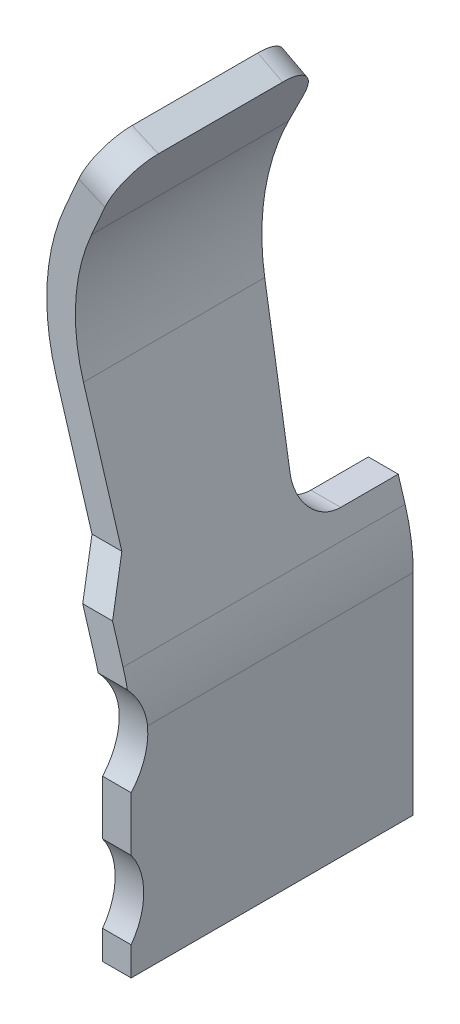
ISO-10303-21;
HEADER;
FILE_DESCRIPTION(('STEP AP214'),'2;1');
FILE_NAME('part.step','',(''),(''),'','','');
FILE_SCHEMA(('AUTOMOTIVE_DESIGN { 1 0 10303 214 1 1 1 1 }'));
ENDSEC;
DATA;
#1=APPLICATION_CONTEXT('core data for automotive mechanical design processes');
#2=APPLICATION_PROTOCOL_DEFINITION('international standard','automotive_design',2000,#1);
#3=PRODUCT_CONTEXT('',#1,'mechanical');
#4=PRODUCT('Part','Part','',(#3));
#5=PRODUCT_RELATED_PRODUCT_CATEGORY('part','',(#4));
#6=PRODUCT_DEFINITION_FORMATION('','',#4);
#7=PRODUCT_DEFINITION_CONTEXT('part definition',#1,'design');
#8=PRODUCT_DEFINITION('design','',#6,#7);
#9=PRODUCT_DEFINITION_SHAPE('','',#8);
#10=(LENGTH_UNIT() NAMED_UNIT(*) SI_UNIT(.MILLI.,.METRE.));
#11=(NAMED_UNIT(*) PLANE_ANGLE_UNIT() SI_UNIT($,.RADIAN.));
#12=(NAMED_UNIT(*) SI_UNIT($,.STERADIAN.) SOLID_ANGLE_UNIT());
#13=UNCERTAINTY_MEASURE_WITH_UNIT(LENGTH_MEASURE(1.E-05),#10,'distance_accuracy_value','');
#14=(GEOMETRIC_REPRESENTATION_CONTEXT(3) GLOBAL_UNCERTAINTY_ASSIGNED_CONTEXT((#13)) GLOBAL_UNIT_ASSIGNED_CONTEXT((#10,
#11,#12)) REPRESENTATION_CONTEXT('',''));
#15=CARTESIAN_POINT('',(0.,0.,0.));
#16=DIRECTION('',(0.,0.,1.));
#17=DIRECTION('',(1.,0.,0.));
#18=AXIS2_PLACEMENT_3D('',#15,#16,#17);
#19=CARTESIAN_POINT('',(-10.8215550668189,3.52330708865174,0.423604352914839));
#20=DIRECTION('',(0.915327071470026,-0.402711251685505,0.));
#21=DIRECTION('',(0.402711251685505,0.915327071470026,0.));
#22=AXIS2_PLACEMENT_3D('',#19,#20,#21);
#23=CYLINDRICAL_SURFACE('',#22,0.2);
#24=CARTESIAN_POINT('',(-10.8215550668189,3.52330708865174,0.423604352914839));
#25=DIRECTION('',(-0.915327071470029,0.402711251685498,0.));
#26=DIRECTION('',(0.402711251685498,0.915327071470029,0.));
#27=AXIS2_PLACEMENT_3D('',#24,#25,#26);
#28=CIRCLE('',#27,0.2);
#29=CARTESIAN_POINT('',(-10.8215550668189,3.52330708865174,0.623604352914839));
#30=VERTEX_POINT('',#29);
#31=CARTESIAN_POINT('',(-10.7410128164818,3.70637250294574,0.423604352914839));
#32=VERTEX_POINT('',#31);
#33=EDGE_CURVE('E286',#30,#32,#28,.T.);
#34=ORIENTED_EDGE('',*,*,#33,.F.);
#35=DIRECTION('',(-0.915327071470027,0.402711251685503,0.));
#36=VECTOR('',#35,1.);
#37=CARTESIAN_POINT('',(-35.4315059297134,14.3508073613119,0.623604352914805));
#38=LINE('',#37,#36);
#39=CARTESIAN_POINT('',(-10.6842560060984,3.46290040089891,0.623604352914839));
#40=VERTEX_POINT('',#39);
#41=EDGE_CURVE('E27',#40,#30,#38,.T.);
#42=ORIENTED_EDGE('',*,*,#41,.F.);
#43=CARTESIAN_POINT('',(-10.6842560060984,3.46290040089891,0.423604352914839));
#44=DIRECTION('',(0.915327071470029,-0.402711251685498,0.));
#45=DIRECTION('',(-0.402711251685498,-0.915327071470029,0.));
#46=AXIS2_PLACEMENT_3D('',#43,#44,#45);
#47=CIRCLE('',#46,0.2);
#48=CARTESIAN_POINT('',(-10.6037137557613,3.64596581519291,0.423604352914839));
#49=VERTEX_POINT('',#48);
#50=EDGE_CURVE('E264',#49,#40,#47,.T.);
#51=ORIENTED_EDGE('',*,*,#50,.F.);
#52=DIRECTION('',(0.915327071470027,-0.402711251685503,0.));
#53=VECTOR('',#52,1.);
#54=CARTESIAN_POINT('',(-10.7410128164818,3.70637250294574,0.423604352914839));
#55=LINE('',#54,#53);
#56=EDGE_CURVE('E330',#32,#49,#55,.T.);
#57=ORIENTED_EDGE('',*,*,#56,.F.);
#58=EDGE_LOOP('',(#34,#42,#51,#57));
#59=FACE_BOUND('',#58,.T.);
#60=ADVANCED_FACE('F16',(#59),#23,.T.);
#61=CARTESIAN_POINT('',(-10.84386274133,3.53312166947706,-0.236832722369337));
#62=DIRECTION('',(-0.914255270392897,0.402239697454475,-0.0483789866630451));
#63=DIRECTION('',(-0.402711251685505,-0.915327071470026,0.));
#64=AXIS2_PLACEMENT_3D('',#61,#62,#63);
#65=CYLINDRICAL_SURFACE('',#64,0.2);
#66=CARTESIAN_POINT('',(-10.6930594619542,3.44289092405021,-0.427421697659668));
#67=CARTESIAN_POINT('',(-10.6419825348076,3.55898426375477,-0.441384710680955));
#68=CARTESIAN_POINT('',(-10.6037137557613,3.64596581519291,-0.356133634256614));
#69=CARTESIAN_POINT('',(-10.6037137557613,3.64596581519291,-0.228386927890316));
#70=(BOUNDED_CURVE() B_SPLINE_CURVE(3,(#66,#67,#68,#69),.UNSPECIFIED.,.F.,
.F.) B_SPLINE_CURVE_WITH_KNOTS((4,4),(6.17366415670651,7.85398163397443),
.UNSPECIFIED.) CURVE() GEOMETRIC_REPRESENTATION_ITEM() RATIONAL_B_SPLINE_CURVE((1.,
0.778229742533869,0.778229742533869,1.)) REPRESENTATION_ITEM(''));
#71=CARTESIAN_POINT('',(-10.6930594619542,3.44289092405021,-0.427421697659668));
#72=VERTEX_POINT('',#71);
#73=CARTESIAN_POINT('',(-10.6037137557613,3.64596581519291,-0.228386927890316));
#74=VERTEX_POINT('',#73);
#75=EDGE_CURVE('E272',#72,#74,#70,.T.);
#76=ORIENTED_EDGE('',*,*,#75,.F.);
#77=DIRECTION('',(0.914255270392898,-0.402239697454473,0.0483789866630451));
#78=VECTOR('',#77,1.);
#79=CARTESIAN_POINT('',(-36.031852655037,14.5910558161891,-1.76825633941021));
#80=LINE('',#79,#78);
#81=CARTESIAN_POINT('',(-10.8303585226747,3.50329761180303,-0.434687053017796));
#82=VERTEX_POINT('',#81);
#83=EDGE_CURVE('E11',#82,#72,#80,.T.);
#84=ORIENTED_EDGE('',*,*,#83,.F.);
#85=CARTESIAN_POINT('',(-10.7410128164818,3.70637250294574,-0.235652283248443));
#86=CARTESIAN_POINT('',(-10.7410128164818,3.70637250294574,-0.363398989614741));
#87=CARTESIAN_POINT('',(-10.7792815955281,3.61939095150759,-0.448650066039082));
#88=CARTESIAN_POINT('',(-10.8303585226747,3.50329761180303,-0.434687053017796));
#89=(BOUNDED_CURVE() B_SPLINE_CURVE(3,(#85,#86,#87,#88),.UNSPECIFIED.,.F.,
.F.) B_SPLINE_CURVE_WITH_KNOTS((4,4),(4.71238898038476,6.39270645765268),
.UNSPECIFIED.) CURVE() GEOMETRIC_REPRESENTATION_ITEM() RATIONAL_B_SPLINE_CURVE((1.,
0.778229742533871,0.778229742533871,1.)) REPRESENTATION_ITEM(''));
#90=CARTESIAN_POINT('',(-10.7410128164818,3.70637250294574,-0.235652283248443));
#91=VERTEX_POINT('',#90);
#92=EDGE_CURVE('E258',#91,#82,#89,.T.);
#93=ORIENTED_EDGE('',*,*,#92,.F.);
#94=DIRECTION('',(-0.914255270392898,0.402239697454473,-0.0483789866630451));
#95=VECTOR('',#94,1.);
#96=CARTESIAN_POINT('',(-10.7633204909929,3.71618708377106,-0.236832722369337));
#97=LINE('',#96,#95);
#98=EDGE_CURVE('E327',#74,#91,#97,.T.);
#99=ORIENTED_EDGE('',*,*,#98,.F.);
#100=EDGE_LOOP('',(#76,#84,#93,#99));
#101=FACE_BOUND('',#100,.T.);
#102=ADVANCED_FACE('F885',(#101),#65,.T.);
#103=CARTESIAN_POINT('',(-40.89,1.65634067151207,-0.212546111318104));
#104=DIRECTION('',(0.,-1.,0.));
#105=DIRECTION('',(0.,0.,-1.));
#106=AXIS2_PLACEMENT_3D('',#103,#104,#105);
#107=PLANE('',#106);
#108=DIRECTION('',(0.,0.,-1.));
#109=VECTOR('',#108,1.);
#110=CARTESIAN_POINT('',(-10.6651649210585,1.65634067151207,-0.740000000000018));
#111=LINE('',#110,#109);
#112=CARTESIAN_POINT('',(-10.6651649210585,1.65634067151207,-0.438042305987952));
#113=VERTEX_POINT('',#112);
#114=CARTESIAN_POINT('',(-10.6651649210585,1.65634067151207,-0.740000000000018));
#115=VERTEX_POINT('',#114);
#116=EDGE_CURVE('E241',#113,#115,#111,.T.);
#117=ORIENTED_EDGE('',*,*,#116,.F.);
#118=DIRECTION('',(1.,0.,0.));
#119=VECTOR('',#118,1.);
#120=CARTESIAN_POINT('',(-10.5084965908944,1.65634067151207,-0.438042305987951));
#121=LINE('',#120,#119);
#122=CARTESIAN_POINT('',(-10.5084965908944,1.65634067151207,-0.438042305987951));
#123=VERTEX_POINT('',#122);
#124=EDGE_CURVE('E250',#113,#123,#121,.T.);
#125=ORIENTED_EDGE('',*,*,#124,.T.);
#126=DIRECTION('',(0.,0.,1.));
#127=VECTOR('',#126,1.);
#128=CARTESIAN_POINT('',(-10.5084965908944,1.65634067151207,-0.740000000000018));
#129=LINE('',#128,#127);
#130=CARTESIAN_POINT('',(-10.5084965908944,1.65634067151207,-0.740000000000018));
#131=VERTEX_POINT('',#130);
#132=EDGE_CURVE('E178',#131,#123,#129,.T.);
#133=ORIENTED_EDGE('',*,*,#132,.F.);
#134=DIRECTION('',(-1.,0.,0.));
#135=VECTOR('',#134,1.);
#136=CARTESIAN_POINT('',(-11.43,1.65634067151207,-0.740000000000019));
#137=LINE('',#136,#135);
#138=EDGE_CURVE('E175',#131,#115,#137,.T.);
#139=ORIENTED_EDGE('',*,*,#138,.T.);
#140=EDGE_LOOP('',(#117,#125,#133,#139));
#141=FACE_BOUND('',#140,.T.);
#142=ADVANCED_FACE('F910',(#141),#107,.F.);
#143=CARTESIAN_POINT('',(-40.89,3.70637250294571,-0.459111687165995));
#144=DIRECTION('',(0.,0.119413416546905,0.992844618230162));
#145=DIRECTION('',(1.,0.,0.));
#146=AXIS2_PLACEMENT_3D('',#143,#144,#145);
#147=PLANE('',#146);
#148=DIRECTION('',(-0.28674853992682,0.951150986717314,-0.11439875574724));
#149=VECTOR('',#148,1.);
#150=CARTESIAN_POINT('',(-10.4903360451115,1.59610175610151,-0.205300934614502));
#151=LINE('',#150,#149);
#152=CARTESIAN_POINT('',(-10.5759916925664,1.88022335482146,-0.239473382341919));
#153=VERTEX_POINT('',#152);
#154=CARTESIAN_POINT('',(-10.7965862640963,2.61194022573825,-0.327479914176621));
#155=VERTEX_POINT('',#154);
#156=EDGE_CURVE('E185',#153,#155,#151,.T.);
#157=ORIENTED_EDGE('',*,*,#156,.F.);
#158=DIRECTION('',(-1.,0.,0.));
#159=VECTOR('',#158,1.);
#160=CARTESIAN_POINT('',(-10.6651649210585,1.88022335482146,-0.23947338234192));
#161=LINE('',#160,#159);
#162=CARTESIAN_POINT('',(-10.7326600227304,1.88022335482146,-0.23947338234192));
#163=VERTEX_POINT('',#162);
#164=EDGE_CURVE('E227',#153,#163,#161,.T.);
#165=ORIENTED_EDGE('',*,*,#164,.T.);
#166=DIRECTION('',(0.286748539926818,-0.951150986717315,0.11439875574724));
#167=VECTOR('',#166,1.);
#168=CARTESIAN_POINT('',(-10.6341223648881,1.55337185451571,-0.200161637444145));
#169=LINE('',#168,#167);
#170=CARTESIAN_POINT('',(-10.9402017604538,2.56864369924933,-0.322272466749579));
#171=VERTEX_POINT('',#170);
#172=EDGE_CURVE('E238',#171,#163,#169,.T.);
#173=ORIENTED_EDGE('',*,*,#172,.F.);
#174=CARTESIAN_POINT('',(-10.8917757539039,3.36370167510267,-0.417897288102545));
#175=CARTESIAN_POINT('',(-11.0033007949067,3.11021511680704,-0.387409439934768));
#176=CARTESIAN_POINT('',(-11.020137394596,2.83379189253285,-0.354162906673266));
#177=CARTESIAN_POINT('',(-10.9402017604538,2.56864369924933,-0.322272466749579));
#178=(BOUNDED_CURVE() B_SPLINE_CURVE(3,(#174,#175,#176,#177),.UNSPECIFIED.,.F.,
.F.) B_SPLINE_CURVE_WITH_KNOTS((4,4),(4.29791199977039,5.00519872138853),
.UNSPECIFIED.) CURVE() GEOMETRIC_REPRESENTATION_ITEM() RATIONAL_B_SPLINE_CURVE((1.,
0.958744787021091,0.958744787021091,1.)) REPRESENTATION_ITEM(''));
#179=CARTESIAN_POINT('',(-10.8917757539039,3.36370167510267,-0.417897288102545));
#180=VERTEX_POINT('',#179);
#181=EDGE_CURVE('E270',#180,#171,#178,.T.);
#182=ORIENTED_EDGE('',*,*,#181,.F.);
#183=DIRECTION('',(-0.400292818236851,-0.909830186054405,0.109428936813832));
#184=VECTOR('',#183,1.);
#185=CARTESIAN_POINT('',(-10.8776664899118,3.39577078475993,-0.421754368938234));
#186=LINE('',#185,#184);
#187=EDGE_CURVE('E287',#82,#180,#186,.T.);
#188=ORIENTED_EDGE('',*,*,#187,.F.);
#189=ORIENTED_EDGE('',*,*,#83,.T.);
#190=DIRECTION('',(0.400292818236852,0.909830186054405,-0.109428936813832));
#191=VECTOR('',#190,1.);
#192=CARTESIAN_POINT('',(-10.7400491803441,3.33608744850051,-0.414576013974332));
#193=LINE('',#192,#191);
#194=CARTESIAN_POINT('',(-10.7544766931834,3.30329498734983,-0.410631932744417));
#195=VERTEX_POINT('',#194);
#196=EDGE_CURVE('E278',#195,#72,#193,.T.);
#197=ORIENTED_EDGE('',*,*,#196,.F.);
#198=CARTESIAN_POINT('',(-10.7965862640963,2.61194022573825,-0.327479914176621));
#199=CARTESIAN_POINT('',(-10.8660955111766,2.84250387207174,-0.355210731501565));
#200=CARTESIAN_POINT('',(-10.8514549897076,3.08287189317973,-0.384120760424611));
#201=CARTESIAN_POINT('',(-10.7544766931834,3.30329498734983,-0.410631932744417));
#202=(BOUNDED_CURVE() B_SPLINE_CURVE(3,(#198,#199,#200,#201),.UNSPECIFIED.,.F.,
.F.) B_SPLINE_CURVE_WITH_KNOTS((4,4),(1.27798658579106,1.98527330740919),
.UNSPECIFIED.) CURVE() GEOMETRIC_REPRESENTATION_ITEM() RATIONAL_B_SPLINE_CURVE((1.,
0.958744787021091,0.958744787021091,1.)) REPRESENTATION_ITEM(''));
#203=EDGE_CURVE('E189',#155,#195,#202,.T.);
#204=ORIENTED_EDGE('',*,*,#203,.F.);
#205=EDGE_LOOP('',(#157,#165,#173,#182,#188,#189,#197,#204));
#206=FACE_BOUND('',#205,.T.);
#207=ADVANCED_FACE('F396',(#206),#147,.F.);
#208=CARTESIAN_POINT('',(-40.89,1.94413292378283,0.623604352914797));
#209=DIRECTION('',(0.,0.,-1.));
#210=DIRECTION('',(0.,-1.,0.));
#211=AXIS2_PLACEMENT_3D('',#208,#209,#210);
#212=PLANE('',#211);
#213=DIRECTION('',(-0.402711251685501,-0.915327071470028,0.));
#214=VECTOR('',#213,1.);
#215=CARTESIAN_POINT('',(-10.7544766931834,3.30329498734984,0.623604352914839));
#216=LINE('',#215,#214);
#217=CARTESIAN_POINT('',(-10.7544766931834,3.30329498734984,0.623604352914839));
#218=VERTEX_POINT('',#217);
#219=EDGE_CURVE('E260',#40,#218,#216,.T.);
#220=ORIENTED_EDGE('',*,*,#219,.F.);
#221=ORIENTED_EDGE('',*,*,#41,.T.);
#222=DIRECTION('',(0.4027112516855,0.915327071470028,0.));
#223=VECTOR('',#222,1.);
#224=CARTESIAN_POINT('',(-10.8917757539039,3.36370167510267,0.623604352914839));
#225=LINE('',#224,#223);
#226=CARTESIAN_POINT('',(-10.8917757539039,3.36370167510267,0.623604352914839));
#227=VERTEX_POINT('',#226);
#228=EDGE_CURVE('E279',#227,#30,#225,.T.);
#229=ORIENTED_EDGE('',*,*,#228,.F.);
#230=CARTESIAN_POINT('',(-9.83914962171339,2.90058373566433,0.62360435291484));
#231=DIRECTION('',(0.,0.,-1.));
#232=DIRECTION('',(-1.,0.,0.));
#233=AXIS2_PLACEMENT_3D('',#230,#231,#232);
#234=CIRCLE('',#233,1.15);
#235=CARTESIAN_POINT('',(-10.9402017604538,2.56864369924933,0.623604352914839));
#236=VERTEX_POINT('',#235);
#237=EDGE_CURVE('E259',#236,#227,#234,.T.);
#238=ORIENTED_EDGE('',*,*,#237,.F.);
#239=DIRECTION('',(-0.288643509926088,0.957436642382956,0.));
#240=VECTOR('',#239,1.);
#241=CARTESIAN_POINT('',(-10.6161788539745,1.49385284836845,0.623604352914839));
#242=LINE('',#241,#240);
#243=CARTESIAN_POINT('',(-10.7519271799357,1.94413292378283,0.623604352914839));
#244=VERTEX_POINT('',#243);
#245=EDGE_CURVE('E597',#244,#236,#242,.T.);
#246=ORIENTED_EDGE('',*,*,#245,.F.);
#247=DIRECTION('',(1.,0.,0.));
#248=VECTOR('',#247,1.);
#249=CARTESIAN_POINT('',(-40.89,1.94413292378283,0.623604352914797));
#250=LINE('',#249,#248);
#251=CARTESIAN_POINT('',(-10.5952588497716,1.94413292378283,0.623604352914839));
#252=VERTEX_POINT('',#251);
#253=EDGE_CURVE('E209',#244,#252,#250,.T.);
#254=ORIENTED_EDGE('',*,*,#253,.T.);
#255=DIRECTION('',(0.28864350992609,-0.957436642382956,0.));
#256=VECTOR('',#255,1.);
#257=CARTESIAN_POINT('',(-10.472563357617,1.53714937485737,0.623604352914839));
#258=LINE('',#257,#256);
#259=CARTESIAN_POINT('',(-10.7965862640963,2.61194022573825,0.623604352914839));
#260=VERTEX_POINT('',#259);
#261=EDGE_CURVE('E300',#260,#252,#258,.T.);
#262=ORIENTED_EDGE('',*,*,#261,.F.);
#263=CARTESIAN_POINT('',(-9.83914962171339,2.90058373566433,0.62360435291484));
#264=DIRECTION('',(0.,0.,1.));
#265=DIRECTION('',(-1.,0.,0.));
#266=AXIS2_PLACEMENT_3D('',#263,#264,#265);
#267=CIRCLE('',#266,1.);
#268=EDGE_CURVE('E179',#218,#260,#267,.T.);
#269=ORIENTED_EDGE('',*,*,#268,.F.);
#270=EDGE_LOOP('',(#220,#221,#229,#238,#246,#254,#262,#269));
#271=FACE_BOUND('',#270,.T.);
#272=ADVANCED_FACE('F894',(#271),#212,.F.);
#273=CARTESIAN_POINT('',(-40.89,1.7003498353216,0.749999999999972));
#274=DIRECTION('',(0.,-0.460287319631494,-0.887770005906065));
#275=DIRECTION('',(0.,-0.887770005906065,0.460287319631494));
#276=AXIS2_PLACEMENT_3D('',#273,#274,#275);
#277=PLANE('',#276);
#278=DIRECTION('',(-1.,0.,0.));
#279=VECTOR('',#278,1.);
#280=CARTESIAN_POINT('',(-11.43,1.7196371362757,0.739999999999981));
#281=LINE('',#280,#279);
#282=CARTESIAN_POINT('',(-10.5275789123207,1.7196371362757,0.739999999999982));
#283=VERTEX_POINT('',#282);
#284=CARTESIAN_POINT('',(-10.6842472424848,1.7196371362757,0.739999999999982));
#285=VERTEX_POINT('',#284);
#286=EDGE_CURVE('E326',#283,#285,#281,.T.);
#287=ORIENTED_EDGE('',*,*,#286,.F.);
#288=DIRECTION('',(0.258541028225372,-0.857586072334425,0.444637678635293));
#289=VECTOR('',#288,1.);
#290=CARTESIAN_POINT('',(-10.6535765616936,2.13757401070795,0.523309818502748));
#291=LINE('',#290,#289);
#292=EDGE_CURVE('E171',#252,#283,#291,.T.);
#293=ORIENTED_EDGE('',*,*,#292,.F.);
#294=ORIENTED_EDGE('',*,*,#253,.F.);
#295=DIRECTION('',(-0.258541028225371,0.857586072334425,-0.444637678635293));
#296=VECTOR('',#295,1.);
#297=CARTESIAN_POINT('',(-10.7997726380838,2.10283732290249,0.541319952677684));
#298=LINE('',#297,#296);
#299=EDGE_CURVE('E244',#285,#244,#298,.T.);
#300=ORIENTED_EDGE('',*,*,#299,.F.);
#301=EDGE_LOOP('',(#287,#293,#294,#300));
#302=FACE_BOUND('',#301,.T.);
#303=ADVANCED_FACE('F626',(#302),#277,.F.);
#304=CARTESIAN_POINT('',(-11.43,1.24850586493128,0.739999999999981));
#305=DIRECTION('',(0.,0.,-1.));
#306=DIRECTION('',(0.,-1.,0.));
#307=AXIS2_PLACEMENT_3D('',#304,#305,#306);
#308=PLANE('',#307);
#309=DIRECTION('',(0.,-1.,0.));
#310=VECTOR('',#309,1.);
#311=CARTESIAN_POINT('',(-10.43,0.145965815192914,0.739999999999982));
#312=LINE('',#311,#310);
#313=CARTESIAN_POINT('',(-10.43,0.296740599868486,0.739999999999982));
#314=VERTEX_POINT('',#313);
#315=CARTESIAN_POINT('',(-10.43,0.145965815192914,0.739999999999982));
#316=VERTEX_POINT('',#315);
#317=EDGE_CURVE('E161',#314,#316,#312,.T.);
#318=ORIENTED_EDGE('',*,*,#317,.F.);
#319=DIRECTION('',(-1.,0.,0.));
#320=VECTOR('',#319,1.);
#321=CARTESIAN_POINT('',(-40.89,0.296740599868486,0.73999999999994));
#322=LINE('',#321,#320);
#323=CARTESIAN_POINT('',(-10.58,0.296740599868486,0.739999999999982));
#324=VERTEX_POINT('',#323);
#325=EDGE_CURVE('E214',#314,#324,#322,.T.);
#326=ORIENTED_EDGE('',*,*,#325,.T.);
#327=DIRECTION('',(0.,1.,0.));
#328=VECTOR('',#327,1.);
#329=CARTESIAN_POINT('',(-10.58,0.145965815192914,0.739999999999982));
#330=LINE('',#329,#328);
#331=CARTESIAN_POINT('',(-10.58,0.145965815192914,0.739999999999982));
#332=VERTEX_POINT('',#331);
#333=EDGE_CURVE('E199',#332,#324,#330,.T.);
#334=ORIENTED_EDGE('',*,*,#333,.F.);
#335=DIRECTION('',(-1.,0.,0.));
#336=VECTOR('',#335,1.);
#337=CARTESIAN_POINT('',(-10.58,0.145965815192914,0.739999999999982));
#338=LINE('',#337,#336);
#339=EDGE_CURVE('E229',#316,#332,#338,.T.);
#340=ORIENTED_EDGE('',*,*,#339,.F.);
#341=EDGE_LOOP('',(#318,#326,#334,#340));
#342=FACE_BOUND('',#341,.T.);
#343=ADVANCED_FACE('F893',(#342),#308,.F.);
#344=CARTESIAN_POINT('',(-11.43,1.24850586493128,-0.740000000000019));
#345=DIRECTION('',(0.,0.,-1.));
#346=DIRECTION('',(0.,-1.,0.));
#347=AXIS2_PLACEMENT_3D('',#344,#345,#346);
#348=PLANE('',#347);
#349=ORIENTED_EDGE('',*,*,#138,.F.);
#350=DIRECTION('',(0.28864350992609,-0.957436642382956,0.));
#351=VECTOR('',#350,1.);
#352=CARTESIAN_POINT('',(-10.472563357617,1.53714937485737,-0.740000000000018));
#353=LINE('',#352,#351);
#354=CARTESIAN_POINT('',(-10.472563357617,1.53714937485737,-0.740000000000018));
#355=VERTEX_POINT('',#354);
#356=EDGE_CURVE('E167',#131,#355,#353,.T.);
#357=ORIENTED_EDGE('',*,*,#356,.T.);
#358=CARTESIAN_POINT('',(-11.43,1.24850586493128,-0.740000000000019));
#359=DIRECTION('',(0.,0.,-1.));
#360=DIRECTION('',(-1.,0.,0.));
#361=AXIS2_PLACEMENT_3D('',#358,#359,#360);
#362=CIRCLE('',#361,1.);
#363=CARTESIAN_POINT('',(-10.43,1.24850586493128,-0.740000000000018));
#364=VERTEX_POINT('',#363);
#365=EDGE_CURVE('E150',#355,#364,#362,.T.);
#366=ORIENTED_EDGE('',*,*,#365,.T.);
#367=DIRECTION('',(0.,-1.,0.));
#368=VECTOR('',#367,1.);
#369=CARTESIAN_POINT('',(-10.43,0.145965815192914,-0.740000000000018));
#370=LINE('',#369,#368);
#371=CARTESIAN_POINT('',(-10.43,0.145965815192914,-0.740000000000018));
#372=VERTEX_POINT('',#371);
#373=EDGE_CURVE('E40',#364,#372,#370,.T.);
#374=ORIENTED_EDGE('',*,*,#373,.T.);
#375=DIRECTION('',(-1.,0.,0.));
#376=VECTOR('',#375,1.);
#377=CARTESIAN_POINT('',(-10.58,0.145965815192914,-0.740000000000018));
#378=LINE('',#377,#376);
#379=CARTESIAN_POINT('',(-10.58,0.145965815192914,-0.740000000000018));
#380=VERTEX_POINT('',#379);
#381=EDGE_CURVE('E357',#372,#380,#378,.T.);
#382=ORIENTED_EDGE('',*,*,#381,.T.);
#383=DIRECTION('',(0.,1.,0.));
#384=VECTOR('',#383,1.);
#385=CARTESIAN_POINT('',(-10.58,0.145965815192914,-0.740000000000018));
#386=LINE('',#385,#384);
#387=CARTESIAN_POINT('',(-10.58,1.24850586493128,-0.740000000000018));
#388=VERTEX_POINT('',#387);
#389=EDGE_CURVE('E195',#380,#388,#386,.T.);
#390=ORIENTED_EDGE('',*,*,#389,.T.);
#391=CARTESIAN_POINT('',(-11.43,1.24850586493128,-0.740000000000019));
#392=DIRECTION('',(0.,0.,1.));
#393=DIRECTION('',(-1.,0.,0.));
#394=AXIS2_PLACEMENT_3D('',#391,#392,#393);
#395=CIRCLE('',#394,0.85);
#396=CARTESIAN_POINT('',(-10.6161788539745,1.49385284836845,-0.740000000000018));
#397=VERTEX_POINT('',#396);
#398=EDGE_CURVE('E205',#388,#397,#395,.T.);
#399=ORIENTED_EDGE('',*,*,#398,.T.);
#400=DIRECTION('',(-0.288643509926088,0.957436642382956,0.));
#401=VECTOR('',#400,1.);
#402=CARTESIAN_POINT('',(-10.6161788539745,1.49385284836845,-0.740000000000018));
#403=LINE('',#402,#401);
#404=EDGE_CURVE('E242',#397,#115,#403,.T.);
#405=ORIENTED_EDGE('',*,*,#404,.T.);
#406=EDGE_LOOP('',(#349,#357,#366,#374,#382,#390,#399,#405));
#407=FACE_BOUND('',#406,.T.);
#408=ADVANCED_FACE('F173',(#407),#348,.T.);
#409=CARTESIAN_POINT('',(-10.43,0.145965815192914,-0.740000000000018));
#410=DIRECTION('',(-1.,0.,0.));
#411=DIRECTION('',(0.,0.,1.));
#412=AXIS2_PLACEMENT_3D('',#409,#410,#411);
#413=PLANE('',#412);
#414=DIRECTION('',(0.,0.,1.));
#415=VECTOR('',#414,1.);
#416=CARTESIAN_POINT('',(-10.43,1.24850586493128,-0.740000000000018));
#417=LINE('',#416,#415);
#418=CARTESIAN_POINT('',(-10.43,1.24850586493128,0.654029100989327));
#419=VERTEX_POINT('',#418);
#420=EDGE_CURVE('E157',#364,#419,#417,.T.);
#421=ORIENTED_EDGE('',*,*,#420,.T.);
#422=CARTESIAN_POINT('',(-10.43,1.21669179396546,0.995153761033099));
#423=DIRECTION('',(1.,0.,0.));
#424=DIRECTION('',(0.,0.,1.));
#425=AXIS2_PLACEMENT_3D('',#422,#423,#424);
#426=CIRCLE('',#425,0.342604974863759);
#427=CARTESIAN_POINT('',(-10.43,0.988055123608201,0.739999999999982));
#428=VERTEX_POINT('',#427);
#429=EDGE_CURVE('E468',#428,#419,#426,.T.);
#430=ORIENTED_EDGE('',*,*,#429,.F.);
#431=DIRECTION('',(0.,-1.,0.));
#432=VECTOR('',#431,1.);
#433=CARTESIAN_POINT('',(-10.43,0.145965815192914,0.739999999999982));
#434=LINE('',#433,#432);
#435=CARTESIAN_POINT('',(-10.43,0.703259400131467,0.739999999999982));
#436=VERTEX_POINT('',#435);
#437=EDGE_CURVE('E333',#428,#436,#434,.T.);
#438=ORIENTED_EDGE('',*,*,#437,.T.);
#439=CARTESIAN_POINT('',(-10.43,0.499999999999977,1.01942683457021));
#440=DIRECTION('',(1.,0.,0.));
#441=DIRECTION('',(0.,0.,1.));
#442=AXIS2_PLACEMENT_3D('',#439,#440,#441);
#443=CIRCLE('',#442,0.345533991988848);
#444=EDGE_CURVE('E216',#314,#436,#443,.T.);
#445=ORIENTED_EDGE('',*,*,#444,.F.);
#446=ORIENTED_EDGE('',*,*,#317,.T.);
#447=DIRECTION('',(0.,0.,1.));
#448=VECTOR('',#447,1.);
#449=CARTESIAN_POINT('',(-10.43,0.145965815192914,-0.740000000000018));
#450=LINE('',#449,#448);
#451=EDGE_CURVE('E443',#372,#316,#450,.T.);
#452=ORIENTED_EDGE('',*,*,#451,.F.);
#453=ORIENTED_EDGE('',*,*,#373,.F.);
#454=EDGE_LOOP('',(#421,#430,#438,#445,#446,#452,#453));
#455=FACE_BOUND('',#454,.T.);
#456=ADVANCED_FACE('F395',(#455),#413,.F.);
#457=CARTESIAN_POINT('',(-11.43,1.24850586493128,-0.740000000000019));
#458=DIRECTION('',(0.,0.,1.));
#459=DIRECTION('',(1.,0.,0.));
#460=AXIS2_PLACEMENT_3D('',#457,#458,#459);
#461=CYLINDRICAL_SURFACE('',#460,1.);
#462=CARTESIAN_POINT('',(-11.43,1.24850586493128,0.739999999999981));
#463=DIRECTION('',(0.,0.,-1.));
#464=DIRECTION('',(-1.,0.,0.));
#465=AXIS2_PLACEMENT_3D('',#462,#463,#464);
#466=CIRCLE('',#465,1.);
#467=CARTESIAN_POINT('',(-10.472563357617,1.53714937485737,0.739999999999982));
#468=VERTEX_POINT('',#467);
#469=CARTESIAN_POINT('',(-10.4495608818653,1.44532846432271,0.739999999999982));
#470=VERTEX_POINT('',#469);
#471=EDGE_CURVE('E418',#468,#470,#466,.T.);
#472=ORIENTED_EDGE('',*,*,#471,.T.);
#473=CARTESIAN_POINT('',(-10.4495608818653,1.44532846432271,0.739999999999982));
#474=CARTESIAN_POINT('',(-10.4488786825832,1.44193024717419,0.736954698545516));
#475=CARTESIAN_POINT('',(-10.4482027814915,1.43847176034268,0.733975045899713));
#476=CARTESIAN_POINT('',(-10.446871440474,1.43145643098167,0.728168909339949));
#477=CARTESIAN_POINT('',(-10.4462159106838,1.42790021102164,0.725341693611874));
#478=CARTESIAN_POINT('',(-10.4449283118303,1.42068928784956,0.719840380711192));
#479=CARTESIAN_POINT('',(-10.4442961617208,1.4170350195159,0.71716573280554));
#480=CARTESIAN_POINT('',(-10.4430584278734,1.40962817005619,0.711969336935339));
#481=CARTESIAN_POINT('',(-10.4424527844787,1.40587584366121,0.709447240161798));
#482=CARTESIAN_POINT('',(-10.4412712287031,1.39827302810706,0.704555749407337));
#483=CARTESIAN_POINT('',(-10.4406952911115,1.39442262647134,0.702186225501929));
#484=CARTESIAN_POINT('',(-10.439576382774,1.38662388081506,0.697599649617342));
#485=CARTESIAN_POINT('',(-10.4390334341832,1.38267547342761,0.695382699975815));
#486=CARTESIAN_POINT('',(-10.4379838039501,1.37468096295901,0.69110105992819));
#487=CARTESIAN_POINT('',(-10.4374772042611,1.37063466501774,0.689036713287309));
#488=CARTESIAN_POINT('',(-10.436503648406,1.36244473872738,0.685059955148913));
#489=CARTESIAN_POINT('',(-10.436036845604,1.3583008060415,0.683148133100318));
#490=CARTESIAN_POINT('',(-10.4351461489827,1.3499144264909,0.679475891500462));
#491=CARTESIAN_POINT('',(-10.434722504929,1.3456715635433,0.677716361222172));
#492=CARTESIAN_POINT('',(-10.4339264719421,1.33713872195227,0.674376033868785));
#493=CARTESIAN_POINT('',(-10.433553810649,1.33284913740284,0.672794295796538));
#494=CARTESIAN_POINT('',(-10.4328613614521,1.32422362544503,0.669809238507263));
#495=CARTESIAN_POINT('',(-10.4325413658501,1.31988795555442,0.668405223722634));
#496=CARTESIAN_POINT('',(-10.4319558558899,1.31117101253269,0.665775382478372));
#497=CARTESIAN_POINT('',(-10.4316902085753,1.30678987892403,0.664549123358656));
#498=CARTESIAN_POINT('',(-10.4312150063215,1.29798278695419,0.662274523841787));
#499=CARTESIAN_POINT('',(-10.4310054020393,1.29355687160866,0.661226027233393));
#500=CARTESIAN_POINT('',(-10.4306438877592,1.28466100981392,0.659306657193421));
#501=CARTESIAN_POINT('',(-10.4304920194512,1.28019103392999,0.658435912321225));
#502=CARTESIAN_POINT('',(-10.4302476084813,1.2712078703344,0.656871822149796));
#503=CARTESIAN_POINT('',(-10.4301552042987,1.26669460642063,0.65617889318397));
#504=CARTESIAN_POINT('',(-10.4300312436239,1.25762568522585,0.654969909316693));
#505=CARTESIAN_POINT('',(-10.429999925878,1.25306993125338,0.654454554866673));
#506=CARTESIAN_POINT('',(-10.43,1.24850586493128,0.654029100989326));
#507=B_SPLINE_CURVE_WITH_KNOTS('',3,(#473,#474,#475,#476,#477,#478,#479,#480,#481,#482,#483,
#484,#485,#486,#487,#488,#489,#490,#491,#492,#493,#494,#495,#496,#497,#498,#499,#500,#501,#502,
#503,#504,#505,#506),.UNSPECIFIED.,.F.,.F.,(4,2,2,2,2,2,2,2,2,2,2,2,2,2,2,2,4),(0.,
0.0138407212061407,0.0276076629969691,0.0413212735159893,0.0550022400252169,0.0686713979829165,
0.082349636791924,0.0960578043228911,0.1098166123811,0.123650992269016,0.137408310969681,
0.151110002599511,0.164777762982779,0.178433449670275,0.192098978145429,0.205796216649483,
0.219546882133365),.UNSPECIFIED.);
#508=EDGE_CURVE('E414',#470,#419,#507,.T.);
#509=ORIENTED_EDGE('',*,*,#508,.T.);
#510=ORIENTED_EDGE('',*,*,#420,.F.);
#511=ORIENTED_EDGE('',*,*,#365,.F.);
#512=DIRECTION('',(0.,0.,1.));
#513=VECTOR('',#512,1.);
#514=CARTESIAN_POINT('',(-10.472563357617,1.53714937485737,-0.740000000000018));
#515=LINE('',#514,#513);
#516=EDGE_CURVE('E154',#355,#468,#515,.T.);
#517=ORIENTED_EDGE('',*,*,#516,.T.);
#518=EDGE_LOOP('',(#472,#509,#510,#511,#517));
#519=FACE_BOUND('',#518,.T.);
#520=ADVANCED_FACE('F153',(#519),#461,.T.);
#521=CARTESIAN_POINT('',(-10.472563357617,1.53714937485737,-0.740000000000018));
#522=DIRECTION('',(-0.957436642382956,-0.28864350992609,0.));
#523=DIRECTION('',(-0.28864350992609,0.957436642382956,0.));
#524=AXIS2_PLACEMENT_3D('',#521,#522,#523);
#525=PLANE('',#524);
#526=ORIENTED_EDGE('',*,*,#356,.F.);
#527=ORIENTED_EDGE('',*,*,#132,.T.);
#528=CARTESIAN_POINT('',(-10.5084965908944,1.65634067151207,-0.438042305987951));
#529=CARTESIAN_POINT('',(-10.5084965908944,1.65634067151208,-0.320885018462571));
#530=CARTESIAN_POINT('',(-10.5334716234365,1.73918338398669,-0.238042305987951));
#531=CARTESIAN_POINT('',(-10.5687916531782,1.85634067151208,-0.238042305987952));
#532=(BOUNDED_CURVE() B_SPLINE_CURVE(3,(#528,#529,#530,#531),.UNSPECIFIED.,.F.,
.F.) B_SPLINE_CURVE_WITH_KNOTS((4,4),(3.1415926535898,4.71238898038469),
.UNSPECIFIED.) CURVE() GEOMETRIC_REPRESENTATION_ITEM() RATIONAL_B_SPLINE_CURVE((1.,
0.804737854124365,0.804737854124365,1.)) REPRESENTATION_ITEM(''));
#533=CARTESIAN_POINT('',(-10.5687916531782,1.85634067151208,-0.238042305987952));
#534=VERTEX_POINT('',#533);
#535=EDGE_CURVE('E307',#123,#534,#532,.T.);
#536=ORIENTED_EDGE('',*,*,#535,.T.);
#537=CARTESIAN_POINT('',(-10.5687916531782,1.85634067151208,-0.238042305987952));
#538=CARTESIAN_POINT('',(-10.5711988444155,1.86432537588468,-0.238042305987952));
#539=CARTESIAN_POINT('',(-10.5736017257013,1.87229578405696,-0.23851990151267));
#540=CARTESIAN_POINT('',(-10.5759916925664,1.88022335482146,-0.239473382341919));
#541=(BOUNDED_CURVE() B_SPLINE_CURVE(3,(#537,#538,#539,#540),.UNSPECIFIED.,.F.,
.F.) B_SPLINE_CURVE_WITH_KNOTS((4,4),(4.71238898038469,4.83208803082147),
.UNSPECIFIED.) CURVE() GEOMETRIC_REPRESENTATION_ITEM() RATIONAL_B_SPLINE_CURVE((1.,
0.998806367803328,0.998806367803328,1.)) REPRESENTATION_ITEM(''));
#542=EDGE_CURVE('E312',#534,#153,#541,.T.);
#543=ORIENTED_EDGE('',*,*,#542,.T.);
#544=ORIENTED_EDGE('',*,*,#156,.T.);
#545=DIRECTION('',(0.,0.,1.));
#546=VECTOR('',#545,1.);
#547=CARTESIAN_POINT('',(-10.7965862640963,2.61194022573825,-0.740000000000018));
#548=LINE('',#547,#546);
#549=EDGE_CURVE('E288',#155,#260,#548,.T.);
#550=ORIENTED_EDGE('',*,*,#549,.T.);
#551=ORIENTED_EDGE('',*,*,#261,.T.);
#552=ORIENTED_EDGE('',*,*,#292,.T.);
#553=DIRECTION('',(0.28864350992609,-0.957436642382956,0.));
#554=VECTOR('',#553,1.);
#555=CARTESIAN_POINT('',(-10.472563357617,1.53714937485737,0.739999999999982));
#556=LINE('',#555,#554);
#557=EDGE_CURVE('E169',#283,#468,#556,.T.);
#558=ORIENTED_EDGE('',*,*,#557,.T.);
#559=ORIENTED_EDGE('',*,*,#516,.F.);
#560=EDGE_LOOP('',(#526,#527,#536,#543,#544,#550,#551,#552,#558,#559));
#561=FACE_BOUND('',#560,.T.);
#562=ADVANCED_FACE('F166',(#561),#525,.F.);
#563=CARTESIAN_POINT('',(-9.83914962171339,2.90058373566433,-0.740000000000017));
#564=DIRECTION('',(0.,0.,1.));
#565=DIRECTION('',(1.,0.,0.));
#566=AXIS2_PLACEMENT_3D('',#563,#564,#565);
#567=CYLINDRICAL_SURFACE('',#566,1.);
#568=ORIENTED_EDGE('',*,*,#549,.F.);
#569=ORIENTED_EDGE('',*,*,#203,.T.);
#570=DIRECTION('',(0.,0.,1.));
#571=VECTOR('',#570,1.);
#572=CARTESIAN_POINT('',(-10.7544766931834,3.30329498734983,-0.740000000000018));
#573=LINE('',#572,#571);
#574=EDGE_CURVE('E263',#195,#218,#573,.T.);
#575=ORIENTED_EDGE('',*,*,#574,.T.);
#576=ORIENTED_EDGE('',*,*,#268,.T.);
#577=EDGE_LOOP('',(#568,#569,#575,#576));
#578=FACE_BOUND('',#577,.T.);
#579=ADVANCED_FACE('F863',(#578),#567,.F.);
#580=CARTESIAN_POINT('',(-10.7544766931834,3.30329498734984,-0.740000000000018));
#581=DIRECTION('',(-0.915327071470028,0.402711251685501,0.));
#582=DIRECTION('',(0.,0.,1.));
#583=AXIS2_PLACEMENT_3D('',#580,#581,#582);
#584=PLANE('',#583);
#585=ORIENTED_EDGE('',*,*,#196,.T.);
#586=ORIENTED_EDGE('',*,*,#75,.T.);
#587=DIRECTION('',(0.,0.,1.));
#588=VECTOR('',#587,1.);
#589=CARTESIAN_POINT('',(-10.6037137557613,3.64596581519291,-0.740000000000018));
#590=LINE('',#589,#588);
#591=EDGE_CURVE('E193',#74,#49,#590,.T.);
#592=ORIENTED_EDGE('',*,*,#591,.T.);
#593=ORIENTED_EDGE('',*,*,#50,.T.);
#594=ORIENTED_EDGE('',*,*,#219,.T.);
#595=ORIENTED_EDGE('',*,*,#574,.F.);
#596=EDGE_LOOP('',(#585,#586,#592,#593,#594,#595));
#597=FACE_BOUND('',#596,.T.);
#598=ADVANCED_FACE('F18',(#597),#584,.F.);
#599=CARTESIAN_POINT('',(-10.7410128164818,3.70637250294574,-0.740000000000018));
#600=DIRECTION('',(-0.402711251685503,-0.915327071470027,0.));
#601=DIRECTION('',(-0.915327071470027,0.402711251685503,0.));
#602=AXIS2_PLACEMENT_3D('',#599,#600,#601);
#603=PLANE('',#602);
#604=ORIENTED_EDGE('',*,*,#591,.F.);
#605=ORIENTED_EDGE('',*,*,#98,.T.);
#606=DIRECTION('',(0.,0.,1.));
#607=VECTOR('',#606,1.);
#608=CARTESIAN_POINT('',(-10.7410128164818,3.70637250294574,-0.740000000000018));
#609=LINE('',#608,#607);
#610=EDGE_CURVE('E251',#91,#32,#609,.T.);
#611=ORIENTED_EDGE('',*,*,#610,.T.);
#612=ORIENTED_EDGE('',*,*,#56,.T.);
#613=EDGE_LOOP('',(#604,#605,#611,#612));
#614=FACE_BOUND('',#613,.T.);
#615=ADVANCED_FACE('F571',(#614),#603,.F.);
#616=CARTESIAN_POINT('',(-10.8917757539039,3.36370167510267,-0.740000000000018));
#617=DIRECTION('',(0.915327071470028,-0.4027112516855,0.));
#618=DIRECTION('',(0.,0.,-1.));
#619=AXIS2_PLACEMENT_3D('',#616,#617,#618);
#620=PLANE('',#619);
#621=ORIENTED_EDGE('',*,*,#610,.F.);
#622=ORIENTED_EDGE('',*,*,#92,.T.);
#623=ORIENTED_EDGE('',*,*,#187,.T.);
#624=DIRECTION('',(0.,0.,1.));
#625=VECTOR('',#624,1.);
#626=CARTESIAN_POINT('',(-10.8917757539039,3.36370167510267,-0.740000000000018));
#627=LINE('',#626,#625);
#628=EDGE_CURVE('E266',#180,#227,#627,.T.);
#629=ORIENTED_EDGE('',*,*,#628,.T.);
#630=ORIENTED_EDGE('',*,*,#228,.T.);
#631=ORIENTED_EDGE('',*,*,#33,.T.);
#632=EDGE_LOOP('',(#621,#622,#623,#629,#630,#631));
#633=FACE_BOUND('',#632,.T.);
#634=ADVANCED_FACE('F961',(#633),#620,.F.);
#635=CARTESIAN_POINT('',(-9.83914962171339,2.90058373566433,-0.740000000000017));
#636=DIRECTION('',(0.,0.,1.));
#637=DIRECTION('',(1.,0.,0.));
#638=AXIS2_PLACEMENT_3D('',#635,#636,#637);
#639=CYLINDRICAL_SURFACE('',#638,1.15);
#640=ORIENTED_EDGE('',*,*,#628,.F.);
#641=ORIENTED_EDGE('',*,*,#181,.T.);
#642=DIRECTION('',(0.,0.,1.));
#643=VECTOR('',#642,1.);
#644=CARTESIAN_POINT('',(-10.9402017604538,2.56864369924933,-0.740000000000019));
#645=LINE('',#644,#643);
#646=EDGE_CURVE('E271',#171,#236,#645,.T.);
#647=ORIENTED_EDGE('',*,*,#646,.T.);
#648=ORIENTED_EDGE('',*,*,#237,.T.);
#649=EDGE_LOOP('',(#640,#641,#647,#648));
#650=FACE_BOUND('',#649,.T.);
#651=ADVANCED_FACE('F660',(#650),#639,.T.);
#652=CARTESIAN_POINT('',(-10.6161788539745,1.49385284836845,-0.740000000000018));
#653=DIRECTION('',(0.957436642382956,0.288643509926088,0.));
#654=DIRECTION('',(0.,0.,-1.));
#655=AXIS2_PLACEMENT_3D('',#652,#653,#654);
#656=PLANE('',#655);
#657=ORIENTED_EDGE('',*,*,#172,.T.);
#658=CARTESIAN_POINT('',(-10.7326600227304,1.88022335482146,-0.23947338234192));
#659=CARTESIAN_POINT('',(-10.7302700558654,1.87229578405696,-0.23851990151267));
#660=CARTESIAN_POINT('',(-10.7278671745795,1.86432537588468,-0.238042305987952));
#661=CARTESIAN_POINT('',(-10.7254599833422,1.85634067151208,-0.238042305987952));
#662=(BOUNDED_CURVE() B_SPLINE_CURVE(3,(#658,#659,#660,#661),.UNSPECIFIED.,.F.,
.F.) B_SPLINE_CURVE_WITH_KNOTS((4,4),(1.45109727635811,1.5707963267949),
.UNSPECIFIED.) CURVE() GEOMETRIC_REPRESENTATION_ITEM() RATIONAL_B_SPLINE_CURVE((1.,
0.998806367803328,0.998806367803328,1.)) REPRESENTATION_ITEM(''));
#663=CARTESIAN_POINT('',(-10.7254599833422,1.85634067151208,-0.238042305987952));
#664=VERTEX_POINT('',#663);
#665=EDGE_CURVE('E221',#163,#664,#662,.T.);
#666=ORIENTED_EDGE('',*,*,#665,.T.);
#667=CARTESIAN_POINT('',(-10.7254599833422,1.85634067151208,-0.238042305987952));
#668=CARTESIAN_POINT('',(-10.6901399536005,1.73918338398669,-0.238042305987952));
#669=CARTESIAN_POINT('',(-10.6651649210585,1.65634067151208,-0.320885018462571));
#670=CARTESIAN_POINT('',(-10.6651649210585,1.65634067151207,-0.438042305987952));
#671=(BOUNDED_CURVE() B_SPLINE_CURVE(3,(#667,#668,#669,#670),.UNSPECIFIED.,.F.,
.F.) B_SPLINE_CURVE_WITH_KNOTS((4,4),(1.5707963267949,3.1415926535898),
.UNSPECIFIED.) CURVE() GEOMETRIC_REPRESENTATION_ITEM() RATIONAL_B_SPLINE_CURVE((1.,
0.804737854124365,0.804737854124365,1.)) REPRESENTATION_ITEM(''));
#672=EDGE_CURVE('E228',#664,#113,#671,.T.);
#673=ORIENTED_EDGE('',*,*,#672,.T.);
#674=ORIENTED_EDGE('',*,*,#116,.T.);
#675=ORIENTED_EDGE('',*,*,#404,.F.);
#676=DIRECTION('',(0.,0.,1.));
#677=VECTOR('',#676,1.);
#678=CARTESIAN_POINT('',(-10.6161788539745,1.49385284836845,-0.740000000000018));
#679=LINE('',#678,#677);
#680=CARTESIAN_POINT('',(-10.6161788539745,1.49385284836845,0.739999999999982));
#681=VERTEX_POINT('',#680);
#682=EDGE_CURVE('E201',#397,#681,#679,.T.);
#683=ORIENTED_EDGE('',*,*,#682,.T.);
#684=DIRECTION('',(-0.288643509926088,0.957436642382956,0.));
#685=VECTOR('',#684,1.);
#686=CARTESIAN_POINT('',(-10.6161788539745,1.49385284836845,0.739999999999982));
#687=LINE('',#686,#685);
#688=EDGE_CURVE('E318',#681,#285,#687,.T.);
#689=ORIENTED_EDGE('',*,*,#688,.T.);
#690=ORIENTED_EDGE('',*,*,#299,.T.);
#691=ORIENTED_EDGE('',*,*,#245,.T.);
#692=ORIENTED_EDGE('',*,*,#646,.F.);
#693=EDGE_LOOP('',(#657,#666,#673,#674,#675,#683,#689,#690,#691,#692));
#694=FACE_BOUND('',#693,.T.);
#695=ADVANCED_FACE('F390',(#694),#656,.F.);
#696=CARTESIAN_POINT('',(-11.43,1.24850586493128,-0.740000000000019));
#697=DIRECTION('',(0.,0.,1.));
#698=DIRECTION('',(1.,0.,0.));
#699=AXIS2_PLACEMENT_3D('',#696,#697,#698);
#700=CYLINDRICAL_SURFACE('',#699,0.85);
#701=DIRECTION('',(0.,0.,1.));
#702=VECTOR('',#701,1.);
#703=CARTESIAN_POINT('',(-10.58,1.24850586493128,-0.740000000000018));
#704=LINE('',#703,#702);
#705=CARTESIAN_POINT('',(-10.58,1.24850586493128,0.654029100989327));
#706=VERTEX_POINT('',#705);
#707=EDGE_CURVE('E200',#388,#706,#704,.T.);
#708=ORIENTED_EDGE('',*,*,#707,.T.);
#709=CARTESIAN_POINT('',(-10.58,1.24850586493128,0.654029100989326));
#710=CARTESIAN_POINT('',(-10.5799999120981,1.25307172693062,0.654454720262645));
#711=CARTESIAN_POINT('',(-10.5800367860582,1.2576292439297,0.65497044121802));
#712=CARTESIAN_POINT('',(-10.5801827631079,1.26670316475237,0.656180580970943));
#713=CARTESIAN_POINT('',(-10.5802916142837,1.2712196564707,0.656874371378024));
#714=CARTESIAN_POINT('',(-10.5805795966021,1.28021043459153,0.658440607166872));
#715=CARTESIAN_POINT('',(-10.5807585933334,1.28468478505172,0.659312709351909));
#716=CARTESIAN_POINT('',(-10.5811847902786,1.29359026706904,0.66123521565365));
#717=CARTESIAN_POINT('',(-10.5814319692243,1.29802141165796,0.662285564130212));
#718=CARTESIAN_POINT('',(-10.5819924970805,1.30683955789749,0.664564290110276));
#719=CARTESIAN_POINT('',(-10.5823059308903,1.31122649527104,0.665792895393331));
#720=CARTESIAN_POINT('',(-10.5829969364554,1.3199553830377,0.668427852265554));
#721=CARTESIAN_POINT('',(-10.5833746903479,1.32429716745913,0.669834705627356));
#722=CARTESIAN_POINT('',(-10.5841923236227,1.33293499859274,0.67282587071001));
#723=CARTESIAN_POINT('',(-10.584632471781,1.33723075608392,0.674410943694387));
#724=CARTESIAN_POINT('',(-10.5855728895693,1.34577581205573,0.677758358644028));
#725=CARTESIAN_POINT('',(-10.586073502642,1.35002467970638,0.679521703002873));
#726=CARTESIAN_POINT('',(-10.587124693327,1.35841002700116,0.68319649068392));
#727=CARTESIAN_POINT('',(-10.5876748333784,1.36254713822208,0.685106618702859));
#728=CARTESIAN_POINT('',(-10.5888224407836,1.37072413591773,0.689079813923092));
#729=CARTESIAN_POINT('',(-10.5894197526584,1.37476428891415,0.691142377362032));
#730=CARTESIAN_POINT('',(-10.5906576588271,1.38274714659941,0.695420264461907));
#731=CARTESIAN_POINT('',(-10.5912981780943,1.38669000475738,0.69763532345596));
#732=CARTESIAN_POINT('',(-10.5926185655259,1.39447822720174,0.702217943435946));
#733=CARTESIAN_POINT('',(-10.5932984257206,1.39832361100899,0.704585473545323));
#734=CARTESIAN_POINT('',(-10.5946936622194,1.40591692940895,0.709472808735537));
#735=CARTESIAN_POINT('',(-10.595409083347,1.40966473145083,0.71199280691319));
#736=CARTESIAN_POINT('',(-10.5968717189092,1.41706305442134,0.717184847198378));
#737=CARTESIAN_POINT('',(-10.5976190162216,1.42071327585296,0.719857292618815));
#738=CARTESIAN_POINT('',(-10.5991417772643,1.4279166306681,0.725354048734386));
#739=CARTESIAN_POINT('',(-10.599917347094,1.43146928614048,0.728178955935315));
#740=CARTESIAN_POINT('',(-10.601493178097,1.43847803402667,0.733980340906898));
#741=CARTESIAN_POINT('',(-10.6022935544036,1.44193346413612,0.73695758776966));
#742=CARTESIAN_POINT('',(-10.6031016601971,1.44532846432271,0.739999999999982));
#743=B_SPLINE_CURVE_WITH_KNOTS('',3,(#709,#710,#711,#712,#713,#714,#715,#716,#717,#718,#719,
#720,#721,#722,#723,#724,#725,#726,#727,#728,#729,#730,#731,#732,#733,#734,#735,#736,#737,#738,
#739,#740,#741,#742),.UNSPECIFIED.,.F.,.F.,(4,2,2,2,2,2,2,2,2,2,2,2,2,2,2,2,4),(0.,
0.0137560099805446,0.0274641281891669,0.0411461066327758,0.054823822033313,0.0685191715441861,
0.0822539679800524,0.096049837049065,0.109928118966885,0.123693986122702,0.137416236292814,
0.151115243353961,0.164811484932943,0.178525451067871,0.192277552593117,0.206088031282382,
0.219976873694123),.UNSPECIFIED.);
#744=CARTESIAN_POINT('',(-10.6031016601971,1.44532846432271,0.739999999999982));
#745=VERTEX_POINT('',#744);
#746=EDGE_CURVE('E215',#706,#745,#743,.T.);
#747=ORIENTED_EDGE('',*,*,#746,.T.);
#748=CARTESIAN_POINT('',(-11.43,1.24850586493128,0.739999999999981));
#749=DIRECTION('',(0.,0.,1.));
#750=DIRECTION('',(-1.,0.,0.));
#751=AXIS2_PLACEMENT_3D('',#748,#749,#750);
#752=CIRCLE('',#751,0.85);
#753=EDGE_CURVE('E325',#745,#681,#752,.T.);
#754=ORIENTED_EDGE('',*,*,#753,.T.);
#755=ORIENTED_EDGE('',*,*,#682,.F.);
#756=ORIENTED_EDGE('',*,*,#398,.F.);
#757=EDGE_LOOP('',(#708,#747,#754,#755,#756));
#758=FACE_BOUND('',#757,.T.);
#759=ADVANCED_FACE('F379',(#758),#700,.F.);
#760=CARTESIAN_POINT('',(-10.58,0.145965815192914,-0.740000000000018));
#761=DIRECTION('',(1.,0.,0.));
#762=DIRECTION('',(0.,0.,1.));
#763=AXIS2_PLACEMENT_3D('',#760,#761,#762);
#764=PLANE('',#763);
#765=DIRECTION('',(0.,1.,0.));
#766=VECTOR('',#765,1.);
#767=CARTESIAN_POINT('',(-10.58,0.145965815192914,0.739999999999982));
#768=LINE('',#767,#766);
#769=CARTESIAN_POINT('',(-10.58,0.703259400131467,0.739999999999982));
#770=VERTEX_POINT('',#769);
#771=CARTESIAN_POINT('',(-10.58,0.988055123608201,0.739999999999982));
#772=VERTEX_POINT('',#771);
#773=EDGE_CURVE('E237',#770,#772,#768,.T.);
#774=ORIENTED_EDGE('',*,*,#773,.T.);
#775=CARTESIAN_POINT('',(-10.58,1.21669179396546,0.995153761033099));
#776=DIRECTION('',(1.,0.,0.));
#777=DIRECTION('',(0.,0.,-1.));
#778=AXIS2_PLACEMENT_3D('',#775,#776,#777);
#779=CIRCLE('',#778,0.342604974863759);
#780=EDGE_CURVE('E311',#772,#706,#779,.T.);
#781=ORIENTED_EDGE('',*,*,#780,.T.);
#782=ORIENTED_EDGE('',*,*,#707,.F.);
#783=ORIENTED_EDGE('',*,*,#389,.F.);
#784=DIRECTION('',(0.,0.,1.));
#785=VECTOR('',#784,1.);
#786=CARTESIAN_POINT('',(-10.58,0.145965815192914,-0.740000000000018));
#787=LINE('',#786,#785);
#788=EDGE_CURVE('E236',#380,#332,#787,.T.);
#789=ORIENTED_EDGE('',*,*,#788,.T.);
#790=ORIENTED_EDGE('',*,*,#333,.T.);
#791=CARTESIAN_POINT('',(-10.58,0.499999999999977,1.01942683457021));
#792=DIRECTION('',(1.,0.,0.));
#793=DIRECTION('',(0.,0.,-1.));
#794=AXIS2_PLACEMENT_3D('',#791,#792,#793);
#795=CIRCLE('',#794,0.345533991988848);
#796=EDGE_CURVE('E210',#324,#770,#795,.T.);
#797=ORIENTED_EDGE('',*,*,#796,.T.);
#798=EDGE_LOOP('',(#774,#781,#782,#783,#789,#790,#797));
#799=FACE_BOUND('',#798,.T.);
#800=ADVANCED_FACE('F389',(#799),#764,.F.);
#801=CARTESIAN_POINT('',(-10.58,0.145965815192914,-0.740000000000018));
#802=DIRECTION('',(0.,1.,0.));
#803=DIRECTION('',(1.,0.,0.));
#804=AXIS2_PLACEMENT_3D('',#801,#802,#803);
#805=PLANE('',#804);
#806=ORIENTED_EDGE('',*,*,#339,.T.);
#807=ORIENTED_EDGE('',*,*,#788,.F.);
#808=ORIENTED_EDGE('',*,*,#381,.F.);
#809=ORIENTED_EDGE('',*,*,#451,.T.);
#810=EDGE_LOOP('',(#806,#807,#808,#809));
#811=FACE_BOUND('',#810,.T.);
#812=ADVANCED_FACE('F876',(#811),#805,.F.);
#813=CARTESIAN_POINT('',(-11.43,1.24850586493128,0.739999999999981));
#814=DIRECTION('',(0.,0.,-1.));
#815=DIRECTION('',(0.,-1.,0.));
#816=AXIS2_PLACEMENT_3D('',#813,#814,#815);
#817=PLANE('',#816);
#818=ORIENTED_EDGE('',*,*,#437,.F.);
#819=DIRECTION('',(-1.,0.,0.));
#820=VECTOR('',#819,1.);
#821=CARTESIAN_POINT('',(-40.89,0.988055123608201,0.73999999999994));
#822=LINE('',#821,#820);
#823=EDGE_CURVE('E449',#428,#772,#822,.T.);
#824=ORIENTED_EDGE('',*,*,#823,.T.);
#825=ORIENTED_EDGE('',*,*,#773,.F.);
#826=DIRECTION('',(1.,0.,0.));
#827=VECTOR('',#826,1.);
#828=CARTESIAN_POINT('',(-40.89,0.703259400131467,0.73999999999994));
#829=LINE('',#828,#827);
#830=EDGE_CURVE('E220',#770,#436,#829,.T.);
#831=ORIENTED_EDGE('',*,*,#830,.T.);
#832=EDGE_LOOP('',(#818,#824,#825,#831));
#833=FACE_BOUND('',#832,.T.);
#834=ADVANCED_FACE('F948',(#833),#817,.F.);
#835=CARTESIAN_POINT('',(-11.43,1.24850586493128,0.739999999999981));
#836=DIRECTION('',(0.,0.,-1.));
#837=DIRECTION('',(0.,-1.,0.));
#838=AXIS2_PLACEMENT_3D('',#835,#836,#837);
#839=PLANE('',#838);
#840=ORIENTED_EDGE('',*,*,#557,.F.);
#841=ORIENTED_EDGE('',*,*,#286,.T.);
#842=ORIENTED_EDGE('',*,*,#688,.F.);
#843=ORIENTED_EDGE('',*,*,#753,.F.);
#844=DIRECTION('',(1.,0.,0.));
#845=VECTOR('',#844,1.);
#846=CARTESIAN_POINT('',(-40.89,1.44532846432271,0.73999999999994));
#847=LINE('',#846,#845);
#848=EDGE_CURVE('E456',#745,#470,#847,.T.);
#849=ORIENTED_EDGE('',*,*,#848,.T.);
#850=ORIENTED_EDGE('',*,*,#471,.F.);
#851=EDGE_LOOP('',(#840,#841,#842,#843,#849,#850));
#852=FACE_BOUND('',#851,.T.);
#853=ADVANCED_FACE('F628',(#852),#839,.F.);
#854=CARTESIAN_POINT('',(-40.89,0.499999999999977,1.01942683457016));
#855=DIRECTION('',(1.,0.,0.));
#856=DIRECTION('',(0.,0.,-1.));
#857=AXIS2_PLACEMENT_3D('',#854,#855,#856);
#858=CYLINDRICAL_SURFACE('',#857,0.345533991988848);
#859=ORIENTED_EDGE('',*,*,#796,.F.);
#860=ORIENTED_EDGE('',*,*,#325,.F.);
#861=ORIENTED_EDGE('',*,*,#444,.T.);
#862=ORIENTED_EDGE('',*,*,#830,.F.);
#863=EDGE_LOOP('',(#859,#860,#861,#862));
#864=FACE_BOUND('',#863,.T.);
#865=ADVANCED_FACE('F430',(#864),#858,.F.);
#866=CARTESIAN_POINT('',(-40.89,1.21669179396546,0.995153761033057));
#867=DIRECTION('',(1.,0.,0.));
#868=DIRECTION('',(0.,0.,-1.));
#869=AXIS2_PLACEMENT_3D('',#866,#867,#868);
#870=CYLINDRICAL_SURFACE('',#869,0.342604974863759);
#871=ORIENTED_EDGE('',*,*,#780,.F.);
#872=ORIENTED_EDGE('',*,*,#823,.F.);
#873=ORIENTED_EDGE('',*,*,#429,.T.);
#874=ORIENTED_EDGE('',*,*,#508,.F.);
#875=ORIENTED_EDGE('',*,*,#848,.F.);
#876=ORIENTED_EDGE('',*,*,#746,.F.);
#877=EDGE_LOOP('',(#871,#872,#873,#874,#875,#876));
#878=FACE_BOUND('',#877,.T.);
#879=ADVANCED_FACE('F420',(#878),#870,.F.);
#880=CARTESIAN_POINT('',(-40.89,1.85634067151208,-0.438042305987994));
#881=DIRECTION('',(-1.,0.,0.));
#882=DIRECTION('',(0.,0.,1.));
#883=AXIS2_PLACEMENT_3D('',#880,#881,#882);
#884=CYLINDRICAL_SURFACE('',#883,0.2);
#885=ORIENTED_EDGE('',*,*,#542,.F.);
#886=ORIENTED_EDGE('',*,*,#535,.F.);
#887=ORIENTED_EDGE('',*,*,#124,.F.);
#888=ORIENTED_EDGE('',*,*,#672,.F.);
#889=ORIENTED_EDGE('',*,*,#665,.F.);
#890=ORIENTED_EDGE('',*,*,#164,.F.);
#891=EDGE_LOOP('',(#885,#886,#887,#888,#889,#890));
#892=FACE_BOUND('',#891,.T.);
#893=ADVANCED_FACE('F429',(#892),#884,.F.);
#894=CLOSED_SHELL('',(#60,#102,#142,#207,#272,#303,#343,#408,#456,#520,#562,#579,#598,#615,#634,
#651,#695,#759,#800,#812,#834,#853,#865,#879,#893));
#895=MANIFOLD_SOLID_BREP('B1',#894);
#896=ADVANCED_BREP_SHAPE_REPRESENTATION('',(#18,#895),#14);
#897=SHAPE_DEFINITION_REPRESENTATION(#9,#896);
ENDSEC;
END-ISO-10303-21;
